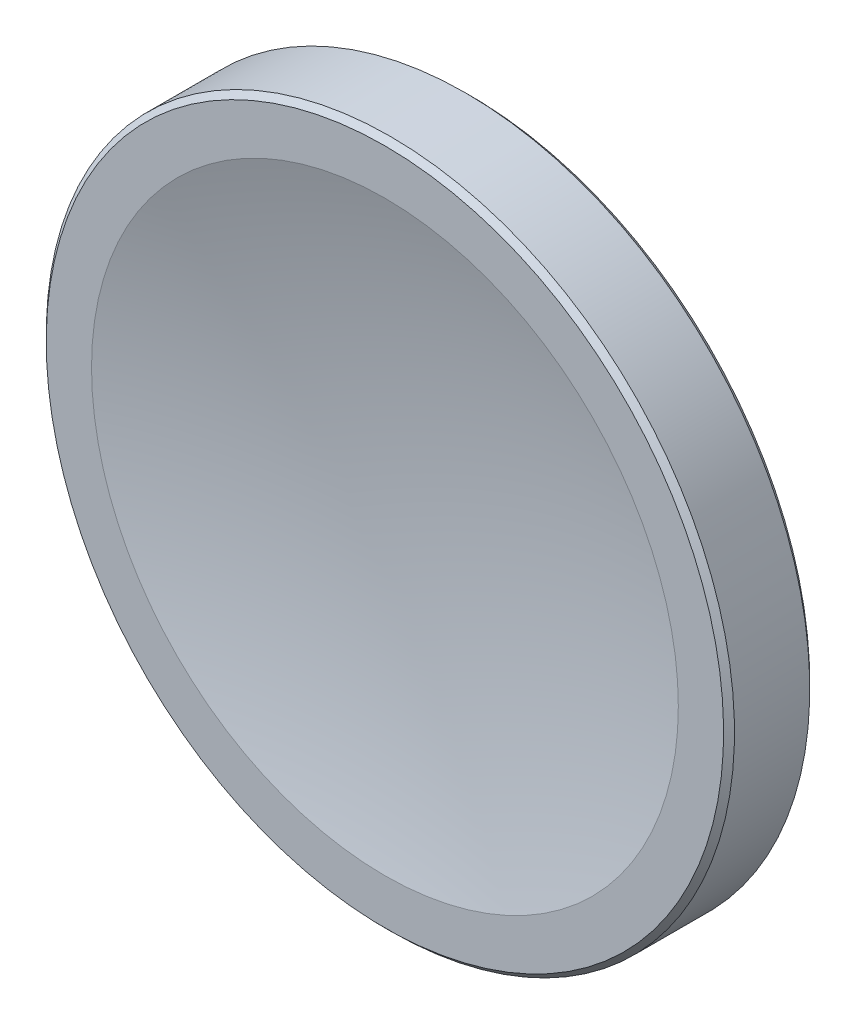
ISO-10303-21;
HEADER;
FILE_DESCRIPTION(('STEP AP214'),'2;1');
FILE_NAME('part.step','',(''),(''),'','','');
FILE_SCHEMA(('AUTOMOTIVE_DESIGN { 1 0 10303 214 1 1 1 1 }'));
ENDSEC;
DATA;
#1=APPLICATION_CONTEXT('core data for automotive mechanical design processes');
#2=APPLICATION_PROTOCOL_DEFINITION('international standard','automotive_design',2000,#1);
#3=PRODUCT_CONTEXT('',#1,'mechanical');
#4=PRODUCT('Part','Part','',(#3));
#5=PRODUCT_RELATED_PRODUCT_CATEGORY('part','',(#4));
#6=PRODUCT_DEFINITION_FORMATION('','',#4);
#7=PRODUCT_DEFINITION_CONTEXT('part definition',#1,'design');
#8=PRODUCT_DEFINITION('design','',#6,#7);
#9=PRODUCT_DEFINITION_SHAPE('','',#8);
#10=(LENGTH_UNIT() NAMED_UNIT(*) SI_UNIT(.MILLI.,.METRE.));
#11=(NAMED_UNIT(*) PLANE_ANGLE_UNIT() SI_UNIT($,.RADIAN.));
#12=(NAMED_UNIT(*) SI_UNIT($,.STERADIAN.) SOLID_ANGLE_UNIT());
#13=UNCERTAINTY_MEASURE_WITH_UNIT(LENGTH_MEASURE(1.E-05),#10,'distance_accuracy_value','');
#14=(GEOMETRIC_REPRESENTATION_CONTEXT(3) GLOBAL_UNCERTAINTY_ASSIGNED_CONTEXT((#13)) GLOBAL_UNIT_ASSIGNED_CONTEXT((#10,
#11,#12)) REPRESENTATION_CONTEXT('',''));
#15=CARTESIAN_POINT('',(0.,0.,0.));
#16=DIRECTION('',(0.,0.,1.));
#17=DIRECTION('',(1.,0.,0.));
#18=AXIS2_PLACEMENT_3D('',#15,#16,#17);
#19=CARTESIAN_POINT('',(0.,0.,662.018));
#20=DIRECTION('',(0.,0.,1.));
#21=DIRECTION('',(0.,1.,0.));
#22=AXIS2_PLACEMENT_3D('',#19,#20,#21);
#23=SPHERICAL_SURFACE('',#22,210.643);
#24=CARTESIAN_POINT('',(0.,0.,458.414283312411));
#25=DIRECTION('',(0.,0.,1.));
#26=DIRECTION('',(0.,-1.,0.));
#27=AXIS2_PLACEMENT_3D('',#24,#25,#26);
#28=CIRCLE('',#27,54.);
#29=CARTESIAN_POINT('',(0.,-53.9999999999999,458.414283312411));
#30=VERTEX_POINT('',#29);
#31=EDGE_CURVE('E56',#30,#30,#28,.T.);
#32=ORIENTED_EDGE('',*,*,#31,.T.);
#33=EDGE_LOOP('',(#32));
#34=FACE_BOUND('',#33,.T.);
#35=ADVANCED_FACE('F36',(#34),#23,.F.);
#36=CARTESIAN_POINT('',(0.,54.,458.414283312411));
#37=DIRECTION('',(0.,0.,-1.));
#38=DIRECTION('',(0.,1.,0.));
#39=AXIS2_PLACEMENT_3D('',#36,#37,#38);
#40=PLANE('',#39);
#41=CARTESIAN_POINT('',(0.,0.,458.414283312411));
#42=DIRECTION('',(0.,0.,-1.));
#43=DIRECTION('',(0.,1.,0.));
#44=AXIS2_PLACEMENT_3D('',#41,#42,#43);
#45=CIRCLE('',#44,62.3349);
#46=CARTESIAN_POINT('',(0.,62.3349,458.414283312411));
#47=VERTEX_POINT('',#46);
#48=EDGE_CURVE('E10',#47,#47,#45,.F.);
#49=ORIENTED_EDGE('',*,*,#48,.T.);
#50=EDGE_LOOP('',(#49));
#51=FACE_BOUND('',#50,.T.);
#52=ORIENTED_EDGE('',*,*,#31,.F.);
#53=EDGE_LOOP('',(#52));
#54=FACE_BOUND('',#53,.T.);
#55=ADVANCED_FACE('F77',(#51,#54),#40,.F.);
#56=CARTESIAN_POINT('',(0.,0.,662.018));
#57=DIRECTION('',(0.,0.,1.));
#58=DIRECTION('',(0.,-1.,0.));
#59=AXIS2_PLACEMENT_3D('',#56,#57,#58);
#60=CYLINDRICAL_SURFACE('',#59,63.3349);
#61=CARTESIAN_POINT('',(0.,0.,443.555821638463));
#62=DIRECTION('',(0.,0.,1.));
#63=DIRECTION('',(0.,-1.,0.));
#64=AXIS2_PLACEMENT_3D('',#61,#62,#63);
#65=CIRCLE('',#64,63.3349);
#66=CARTESIAN_POINT('',(0.,-63.3348999999999,443.555821638463));
#67=VERTEX_POINT('',#66);
#68=EDGE_CURVE('E47',#67,#67,#65,.T.);
#69=ORIENTED_EDGE('',*,*,#68,.T.);
#70=EDGE_LOOP('',(#69));
#71=FACE_BOUND('',#70,.T.);
#72=CARTESIAN_POINT('',(0.,0.,457.414283312411));
#73=DIRECTION('',(0.,0.,-1.));
#74=DIRECTION('',(0.,1.,0.));
#75=AXIS2_PLACEMENT_3D('',#72,#73,#74);
#76=CIRCLE('',#75,63.3349);
#77=CARTESIAN_POINT('',(0.,63.3349,457.414283312411));
#78=VERTEX_POINT('',#77);
#79=EDGE_CURVE('E51',#78,#78,#76,.T.);
#80=ORIENTED_EDGE('',*,*,#79,.T.);
#81=EDGE_LOOP('',(#80));
#82=FACE_BOUND('',#81,.T.);
#83=ADVANCED_FACE('F74',(#71,#82),#60,.T.);
#84=CARTESIAN_POINT('',(0.,63.3349,442.555821638463));
#85=DIRECTION('',(0.,0.,1.));
#86=DIRECTION('',(0.,-1.,0.));
#87=AXIS2_PLACEMENT_3D('',#84,#85,#86);
#88=PLANE('',#87);
#89=CARTESIAN_POINT('',(0.,0.,442.555821638463));
#90=DIRECTION('',(0.,0.,1.));
#91=DIRECTION('',(0.,-1.,0.));
#92=AXIS2_PLACEMENT_3D('',#89,#90,#91);
#93=CIRCLE('',#92,62.3348999999999);
#94=CARTESIAN_POINT('',(0.,-62.3348999999999,442.555821638463));
#95=VERTEX_POINT('',#94);
#96=EDGE_CURVE('E43',#95,#95,#93,.F.);
#97=ORIENTED_EDGE('',*,*,#96,.T.);
#98=EDGE_LOOP('',(#97));
#99=FACE_BOUND('',#98,.T.);
#100=CARTESIAN_POINT('',(0.,0.,442.555821638463));
#101=DIRECTION('',(0.,0.,1.));
#102=DIRECTION('',(0.,-1.,0.));
#103=AXIS2_PLACEMENT_3D('',#100,#101,#102);
#104=CIRCLE('',#103,54.);
#105=CARTESIAN_POINT('',(0.,-53.9999999999999,442.555821638463));
#106=VERTEX_POINT('',#105);
#107=EDGE_CURVE('E59',#106,#106,#104,.T.);
#108=ORIENTED_EDGE('',*,*,#107,.T.);
#109=EDGE_LOOP('',(#108));
#110=FACE_BOUND('',#109,.T.);
#111=ADVANCED_FACE('F63',(#99,#110),#88,.F.);
#112=CARTESIAN_POINT('',(0.,2.4322146740338E-13,-662.018));
#113=DIRECTION('',(0.,0.,1.));
#114=DIRECTION('',(0.,1.,0.));
#115=AXIS2_PLACEMENT_3D('',#112,#113,#114);
#116=SPHERICAL_SURFACE('',#115,1105.893);
#117=ORIENTED_EDGE('',*,*,#107,.F.);
#118=EDGE_LOOP('',(#117));
#119=FACE_BOUND('',#118,.T.);
#120=ADVANCED_FACE('F65',(#119),#116,.F.);
#121=CARTESIAN_POINT('',(0.,0.,443.555821638463));
#122=DIRECTION('',(0.,0.,1.));
#123=DIRECTION('',(0.,-1.,0.));
#124=AXIS2_PLACEMENT_3D('',#121,#122,#123);
#125=CONICAL_SURFACE('',#124,63.3349,0.785398163397448);
#126=ORIENTED_EDGE('',*,*,#96,.F.);
#127=EDGE_LOOP('',(#126));
#128=FACE_BOUND('',#127,.T.);
#129=ORIENTED_EDGE('',*,*,#68,.F.);
#130=EDGE_LOOP('',(#129));
#131=FACE_BOUND('',#130,.T.);
#132=ADVANCED_FACE('F67',(#128,#131),#125,.T.);
#133=CARTESIAN_POINT('',(0.,0.,458.414283312411));
#134=DIRECTION('',(0.,0.,-1.));
#135=DIRECTION('',(0.,1.,0.));
#136=AXIS2_PLACEMENT_3D('',#133,#134,#135);
#137=CONICAL_SURFACE('',#136,62.3349,0.785398163397421);
#138=ORIENTED_EDGE('',*,*,#79,.F.);
#139=EDGE_LOOP('',(#138));
#140=FACE_BOUND('',#139,.T.);
#141=ORIENTED_EDGE('',*,*,#48,.F.);
#142=EDGE_LOOP('',(#141));
#143=FACE_BOUND('',#142,.T.);
#144=ADVANCED_FACE('F38',(#140,#143),#137,.T.);
#145=CLOSED_SHELL('',(#35,#55,#83,#111,#120,#132,#144));
#146=MANIFOLD_SOLID_BREP('B2',#145);
#147=ADVANCED_BREP_SHAPE_REPRESENTATION('',(#18,#146),#14);
#148=SHAPE_DEFINITION_REPRESENTATION(#9,#147);
ENDSEC;
END-ISO-10303-21;
